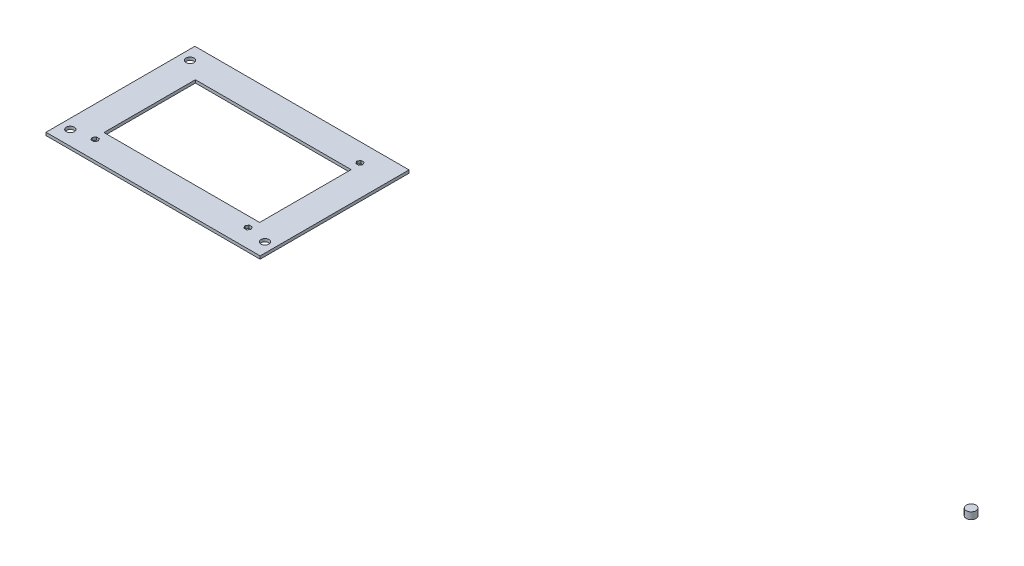
ISO-10303-21;
HEADER;
FILE_DESCRIPTION(('STEP AP214'),'2;1');
FILE_NAME('part.step','',(''),(''),'','','');
FILE_SCHEMA(('AUTOMOTIVE_DESIGN { 1 0 10303 214 1 1 1 1 }'));
ENDSEC;
DATA;
#1=APPLICATION_CONTEXT('core data for automotive mechanical design processes');
#2=APPLICATION_PROTOCOL_DEFINITION('international standard','automotive_design',2000,#1);
#3=PRODUCT_CONTEXT('',#1,'mechanical');
#4=PRODUCT('Part','Part','',(#3));
#5=PRODUCT_RELATED_PRODUCT_CATEGORY('part','',(#4));
#6=PRODUCT_DEFINITION_FORMATION('','',#4);
#7=PRODUCT_DEFINITION_CONTEXT('part definition',#1,'design');
#8=PRODUCT_DEFINITION('design','',#6,#7);
#9=PRODUCT_DEFINITION_SHAPE('','',#8);
#10=(LENGTH_UNIT() NAMED_UNIT(*) SI_UNIT(.MILLI.,.METRE.));
#11=(NAMED_UNIT(*) PLANE_ANGLE_UNIT() SI_UNIT($,.RADIAN.));
#12=(NAMED_UNIT(*) SI_UNIT($,.STERADIAN.) SOLID_ANGLE_UNIT());
#13=UNCERTAINTY_MEASURE_WITH_UNIT(LENGTH_MEASURE(1.E-05),#10,'distance_accuracy_value','');
#14=(GEOMETRIC_REPRESENTATION_CONTEXT(3) GLOBAL_UNCERTAINTY_ASSIGNED_CONTEXT((#13)) GLOBAL_UNIT_ASSIGNED_CONTEXT((#10,
#11,#12)) REPRESENTATION_CONTEXT('',''));
#15=CARTESIAN_POINT('',(0.,0.,0.));
#16=DIRECTION('',(0.,0.,1.));
#17=DIRECTION('',(1.,0.,0.));
#18=AXIS2_PLACEMENT_3D('',#15,#16,#17);
#19=CARTESIAN_POINT('',(706.5,10.,-57.5000000000001));
#20=DIRECTION('',(0.,-1.,0.));
#21=DIRECTION('',(0.,0.,-1.));
#22=AXIS2_PLACEMENT_3D('',#19,#20,#21);
#23=CYLINDRICAL_SURFACE('',#22,5.00000000000005);
#24=CARTESIAN_POINT('',(706.5,10.,-57.5000000000001));
#25=DIRECTION('',(0.,1.,0.));
#26=DIRECTION('',(0.,0.,1.));
#27=AXIS2_PLACEMENT_3D('',#24,#25,#26);
#28=CIRCLE('',#27,5.00000000000005);
#29=CARTESIAN_POINT('',(706.5,10.,-52.5));
#30=VERTEX_POINT('',#29);
#31=EDGE_CURVE('E11',#30,#30,#28,.T.);
#32=ORIENTED_EDGE('',*,*,#31,.F.);
#33=EDGE_LOOP('',(#32));
#34=FACE_BOUND('',#33,.T.);
#35=CARTESIAN_POINT('',(706.5,3.,-57.5000000000001));
#36=DIRECTION('',(0.,1.,0.));
#37=DIRECTION('',(0.,0.,1.));
#38=AXIS2_PLACEMENT_3D('',#35,#36,#37);
#39=CIRCLE('',#38,5.00000000000005);
#40=CARTESIAN_POINT('',(706.5,3.,-52.5));
#41=VERTEX_POINT('',#40);
#42=EDGE_CURVE('E44',#41,#41,#39,.T.);
#43=ORIENTED_EDGE('',*,*,#42,.T.);
#44=EDGE_LOOP('',(#43));
#45=FACE_BOUND('',#44,.T.);
#46=ADVANCED_FACE('F41',(#34,#45),#23,.T.);
#47=CARTESIAN_POINT('',(706.5,10.,-57.5000000000001));
#48=DIRECTION('',(0.,1.,0.));
#49=DIRECTION('',(0.,0.,1.));
#50=AXIS2_PLACEMENT_3D('',#47,#48,#49);
#51=PLANE('',#50);
#52=ORIENTED_EDGE('',*,*,#31,.T.);
#53=EDGE_LOOP('',(#52));
#54=FACE_BOUND('',#53,.T.);
#55=ADVANCED_FACE('F56',(#54),#51,.T.);
#56=CARTESIAN_POINT('',(706.5,3.,-57.5000000000001));
#57=DIRECTION('',(0.,1.,0.));
#58=DIRECTION('',(0.,0.,1.));
#59=AXIS2_PLACEMENT_3D('',#56,#57,#58);
#60=PLANE('',#59);
#61=ORIENTED_EDGE('',*,*,#42,.F.);
#62=EDGE_LOOP('',(#61));
#63=FACE_BOUND('',#62,.T.);
#64=ADVANCED_FACE('F54',(#63),#60,.F.);
#65=CLOSED_SHELL('',(#46,#55,#64));
#66=MANIFOLD_SOLID_BREP('B2',#65);
#67=CARTESIAN_POINT('',(0.,3.,0.));
#68=DIRECTION('',(0.,1.,0.));
#69=DIRECTION('',(0.,0.,1.));
#70=AXIS2_PLACEMENT_3D('',#67,#68,#69);
#71=PLANE('',#70);
#72=DIRECTION('',(0.499999999999996,0.,0.866025403784441));
#73=VECTOR('',#72,1.);
#74=CARTESIAN_POINT('',(-76.9122867597286,3.,54.75));
#75=LINE('',#74,#73);
#76=CARTESIAN_POINT('',(-76.9122867597286,3.,54.75));
#77=VERTEX_POINT('',#76);
#78=CARTESIAN_POINT('',(-75.3245735194571,3.,57.5000000000001));
#79=VERTEX_POINT('',#78);
#80=EDGE_CURVE('E304',#77,#79,#75,.T.);
#81=ORIENTED_EDGE('',*,*,#80,.T.);
#82=DIRECTION('',(-0.5,0.,0.866025403784439));
#83=VECTOR('',#82,1.);
#84=CARTESIAN_POINT('',(-75.3245735194571,3.,57.5000000000001));
#85=LINE('',#84,#83);
#86=CARTESIAN_POINT('',(-76.9122867597286,3.,60.2500000000001));
#87=VERTEX_POINT('',#86);
#88=EDGE_CURVE('E307',#79,#87,#85,.T.);
#89=ORIENTED_EDGE('',*,*,#88,.T.);
#90=DIRECTION('',(-1.,0.,0.));
#91=VECTOR('',#90,1.);
#92=CARTESIAN_POINT('',(-76.9122867597286,3.,60.2500000000001));
#93=LINE('',#92,#91);
#94=CARTESIAN_POINT('',(-80.0877132402715,3.,60.2500000000001));
#95=VERTEX_POINT('',#94);
#96=EDGE_CURVE('E311',#87,#95,#93,.T.);
#97=ORIENTED_EDGE('',*,*,#96,.T.);
#98=DIRECTION('',(-0.5,0.,-0.866025403784439));
#99=VECTOR('',#98,1.);
#100=CARTESIAN_POINT('',(-80.0877132402715,3.,60.2500000000001));
#101=LINE('',#100,#99);
#102=CARTESIAN_POINT('',(-81.6754264805431,3.,57.5));
#103=VERTEX_POINT('',#102);
#104=EDGE_CURVE('E314',#95,#103,#101,.T.);
#105=ORIENTED_EDGE('',*,*,#104,.T.);
#106=DIRECTION('',(0.500000000000005,0.,-0.866025403784435));
#107=VECTOR('',#106,1.);
#108=CARTESIAN_POINT('',(-81.6754264805431,3.,57.5));
#109=LINE('',#108,#107);
#110=CARTESIAN_POINT('',(-80.0877132402715,3.,54.75));
#111=VERTEX_POINT('',#110);
#112=EDGE_CURVE('E317',#103,#111,#109,.T.);
#113=ORIENTED_EDGE('',*,*,#112,.T.);
#114=DIRECTION('',(1.,0.,0.));
#115=VECTOR('',#114,1.);
#116=CARTESIAN_POINT('',(-80.0877132402715,3.,54.75));
#117=LINE('',#116,#115);
#118=EDGE_CURVE('E320',#111,#77,#117,.T.);
#119=ORIENTED_EDGE('',*,*,#118,.T.);
#120=EDGE_LOOP('',(#81,#89,#97,#105,#113,#119));
#121=FACE_BOUND('',#120,.T.);
#122=CARTESIAN_POINT('',(100.,3.,61.5));
#123=DIRECTION('',(0.,1.,0.));
#124=DIRECTION('',(0.,0.,-1.));
#125=AXIS2_PLACEMENT_3D('',#122,#123,#124);
#126=CIRCLE('',#125,4.1);
#127=CARTESIAN_POINT('',(100.,3.,57.4));
#128=VERTEX_POINT('',#127);
#129=EDGE_CURVE('E341',#128,#128,#126,.T.);
#130=ORIENTED_EDGE('',*,*,#129,.F.);
#131=EDGE_LOOP('',(#130));
#132=FACE_BOUND('',#131,.T.);
#133=CARTESIAN_POINT('',(-100.,3.,61.5));
#134=DIRECTION('',(0.,-1.,0.));
#135=DIRECTION('',(0.,0.,-1.));
#136=AXIS2_PLACEMENT_3D('',#133,#134,#135);
#137=CIRCLE('',#136,4.1);
#138=CARTESIAN_POINT('',(-100.,3.,57.4));
#139=VERTEX_POINT('',#138);
#140=EDGE_CURVE('E355',#139,#139,#137,.T.);
#141=ORIENTED_EDGE('',*,*,#140,.T.);
#142=EDGE_LOOP('',(#141));
#143=FACE_BOUND('',#142,.T.);
#144=DIRECTION('',(-0.499999999999996,0.,-0.866025403784441));
#145=VECTOR('',#144,1.);
#146=CARTESIAN_POINT('',(76.9122867597286,3.,-54.75));
#147=LINE('',#146,#145);
#148=CARTESIAN_POINT('',(76.9122867597286,3.,-54.75));
#149=VERTEX_POINT('',#148);
#150=CARTESIAN_POINT('',(75.3245735194571,3.,-57.5000000000001));
#151=VERTEX_POINT('',#150);
#152=EDGE_CURVE('E364',#149,#151,#147,.T.);
#153=ORIENTED_EDGE('',*,*,#152,.T.);
#154=DIRECTION('',(0.5,0.,-0.866025403784439));
#155=VECTOR('',#154,1.);
#156=CARTESIAN_POINT('',(75.3245735194571,3.,-57.5000000000001));
#157=LINE('',#156,#155);
#158=CARTESIAN_POINT('',(76.9122867597286,3.,-60.2500000000001));
#159=VERTEX_POINT('',#158);
#160=EDGE_CURVE('E367',#151,#159,#157,.T.);
#161=ORIENTED_EDGE('',*,*,#160,.T.);
#162=DIRECTION('',(1.,0.,0.));
#163=VECTOR('',#162,1.);
#164=CARTESIAN_POINT('',(76.9122867597286,3.,-60.2500000000001));
#165=LINE('',#164,#163);
#166=CARTESIAN_POINT('',(80.0877132402715,3.,-60.2500000000001));
#167=VERTEX_POINT('',#166);
#168=EDGE_CURVE('E371',#159,#167,#165,.T.);
#169=ORIENTED_EDGE('',*,*,#168,.T.);
#170=DIRECTION('',(0.5,0.,0.866025403784439));
#171=VECTOR('',#170,1.);
#172=CARTESIAN_POINT('',(80.0877132402715,3.,-60.2500000000001));
#173=LINE('',#172,#171);
#174=CARTESIAN_POINT('',(81.6754264805431,3.,-57.5));
#175=VERTEX_POINT('',#174);
#176=EDGE_CURVE('E374',#167,#175,#173,.T.);
#177=ORIENTED_EDGE('',*,*,#176,.T.);
#178=DIRECTION('',(-0.500000000000005,0.,0.866025403784435));
#179=VECTOR('',#178,1.);
#180=CARTESIAN_POINT('',(81.6754264805431,3.,-57.5));
#181=LINE('',#180,#179);
#182=CARTESIAN_POINT('',(80.0877132402715,3.,-54.75));
#183=VERTEX_POINT('',#182);
#184=EDGE_CURVE('E377',#175,#183,#181,.T.);
#185=ORIENTED_EDGE('',*,*,#184,.T.);
#186=DIRECTION('',(-1.,0.,0.));
#187=VECTOR('',#186,1.);
#188=CARTESIAN_POINT('',(80.0877132402715,3.,-54.75));
#189=LINE('',#188,#187);
#190=EDGE_CURVE('E380',#183,#149,#189,.T.);
#191=ORIENTED_EDGE('',*,*,#190,.T.);
#192=EDGE_LOOP('',(#153,#161,#169,#177,#185,#191));
#193=FACE_BOUND('',#192,.T.);
#194=CARTESIAN_POINT('',(-100.,3.,-61.5));
#195=DIRECTION('',(0.,1.,0.));
#196=DIRECTION('',(0.,0.,1.));
#197=AXIS2_PLACEMENT_3D('',#194,#195,#196);
#198=CIRCLE('',#197,4.1);
#199=CARTESIAN_POINT('',(-100.,3.,-57.4));
#200=VERTEX_POINT('',#199);
#201=EDGE_CURVE('E401',#200,#200,#198,.T.);
#202=ORIENTED_EDGE('',*,*,#201,.F.);
#203=EDGE_LOOP('',(#202));
#204=FACE_BOUND('',#203,.T.);
#205=DIRECTION('',(0.,0.,-1.));
#206=VECTOR('',#205,1.);
#207=CARTESIAN_POINT('',(80.,3.,-47.));
#208=LINE('',#207,#206);
#209=CARTESIAN_POINT('',(80.,3.,47.));
#210=VERTEX_POINT('',#209);
#211=CARTESIAN_POINT('',(80.,3.,-47.));
#212=VERTEX_POINT('',#211);
#213=EDGE_CURVE('E415',#210,#212,#208,.T.);
#214=ORIENTED_EDGE('',*,*,#213,.F.);
#215=DIRECTION('',(1.,0.,0.));
#216=VECTOR('',#215,1.);
#217=CARTESIAN_POINT('',(-80.,3.,47.));
#218=LINE('',#217,#216);
#219=CARTESIAN_POINT('',(-80.,3.,47.));
#220=VERTEX_POINT('',#219);
#221=EDGE_CURVE('E422',#220,#210,#218,.T.);
#222=ORIENTED_EDGE('',*,*,#221,.F.);
#223=DIRECTION('',(0.,0.,1.));
#224=VECTOR('',#223,1.);
#225=CARTESIAN_POINT('',(-80.,3.,-47.));
#226=LINE('',#225,#224);
#227=CARTESIAN_POINT('',(-80.,3.,-47.));
#228=VERTEX_POINT('',#227);
#229=EDGE_CURVE('E436',#228,#220,#226,.T.);
#230=ORIENTED_EDGE('',*,*,#229,.F.);
#231=DIRECTION('',(-1.,0.,0.));
#232=VECTOR('',#231,1.);
#233=CARTESIAN_POINT('',(-80.,3.,-47.));
#234=LINE('',#233,#232);
#235=EDGE_CURVE('E433',#212,#228,#234,.T.);
#236=ORIENTED_EDGE('',*,*,#235,.F.);
#237=EDGE_LOOP('',(#214,#222,#230,#236));
#238=FACE_BOUND('',#237,.T.);
#239=DIRECTION('',(0.,0.,-1.));
#240=VECTOR('',#239,1.);
#241=CARTESIAN_POINT('',(110.,3.,-76.5));
#242=LINE('',#241,#240);
#243=CARTESIAN_POINT('',(110.,3.,76.5));
#244=VERTEX_POINT('',#243);
#245=CARTESIAN_POINT('',(110.,3.,-76.5));
#246=VERTEX_POINT('',#245);
#247=EDGE_CURVE('E450',#244,#246,#242,.T.);
#248=ORIENTED_EDGE('',*,*,#247,.T.);
#249=DIRECTION('',(-1.,0.,0.));
#250=VECTOR('',#249,1.);
#251=CARTESIAN_POINT('',(-110.,3.,-76.5));
#252=LINE('',#251,#250);
#253=CARTESIAN_POINT('',(-110.,3.,-76.5));
#254=VERTEX_POINT('',#253);
#255=EDGE_CURVE('E453',#246,#254,#252,.T.);
#256=ORIENTED_EDGE('',*,*,#255,.T.);
#257=DIRECTION('',(0.,0.,1.));
#258=VECTOR('',#257,1.);
#259=CARTESIAN_POINT('',(-110.,3.,-76.5));
#260=LINE('',#259,#258);
#261=CARTESIAN_POINT('',(-110.,3.,76.5));
#262=VERTEX_POINT('',#261);
#263=EDGE_CURVE('E456',#254,#262,#260,.T.);
#264=ORIENTED_EDGE('',*,*,#263,.T.);
#265=DIRECTION('',(1.,0.,0.));
#266=VECTOR('',#265,1.);
#267=CARTESIAN_POINT('',(-110.,3.,76.5));
#268=LINE('',#267,#266);
#269=EDGE_CURVE('E458',#262,#244,#268,.T.);
#270=ORIENTED_EDGE('',*,*,#269,.T.);
#271=EDGE_LOOP('',(#248,#256,#264,#270));
#272=FACE_BOUND('',#271,.T.);
#273=DIRECTION('',(0.5,0.,0.866025403784439));
#274=VECTOR('',#273,1.);
#275=CARTESIAN_POINT('',(75.3245735194571,3.,57.5000000000001));
#276=LINE('',#275,#274);
#277=CARTESIAN_POINT('',(75.3245735194571,3.,57.5000000000001));
#278=VERTEX_POINT('',#277);
#279=CARTESIAN_POINT('',(76.9122867597286,3.,60.2500000000001));
#280=VERTEX_POINT('',#279);
#281=EDGE_CURVE('E267',#278,#280,#276,.T.);
#282=ORIENTED_EDGE('',*,*,#281,.F.);
#283=DIRECTION('',(-0.499999999999996,0.,0.866025403784441));
#284=VECTOR('',#283,1.);
#285=CARTESIAN_POINT('',(76.9122867597286,3.,54.75));
#286=LINE('',#285,#284);
#287=CARTESIAN_POINT('',(76.9122867597286,3.,54.75));
#288=VERTEX_POINT('',#287);
#289=EDGE_CURVE('E263',#288,#278,#286,.T.);
#290=ORIENTED_EDGE('',*,*,#289,.F.);
#291=DIRECTION('',(-1.,0.,0.));
#292=VECTOR('',#291,1.);
#293=CARTESIAN_POINT('',(80.0877132402715,3.,54.75));
#294=LINE('',#293,#292);
#295=CARTESIAN_POINT('',(80.0877132402715,3.,54.75));
#296=VERTEX_POINT('',#295);
#297=EDGE_CURVE('E255',#296,#288,#294,.T.);
#298=ORIENTED_EDGE('',*,*,#297,.F.);
#299=DIRECTION('',(-0.500000000000005,0.,-0.866025403784435));
#300=VECTOR('',#299,1.);
#301=CARTESIAN_POINT('',(81.6754264805431,3.,57.5));
#302=LINE('',#301,#300);
#303=CARTESIAN_POINT('',(81.6754264805431,3.,57.5));
#304=VERTEX_POINT('',#303);
#305=EDGE_CURVE('E262',#304,#296,#302,.T.);
#306=ORIENTED_EDGE('',*,*,#305,.F.);
#307=DIRECTION('',(0.5,0.,-0.866025403784439));
#308=VECTOR('',#307,1.);
#309=CARTESIAN_POINT('',(80.0877132402715,3.,60.2500000000001));
#310=LINE('',#309,#308);
#311=CARTESIAN_POINT('',(80.0877132402715,3.,60.2500000000001));
#312=VERTEX_POINT('',#311);
#313=EDGE_CURVE('E278',#312,#304,#310,.T.);
#314=ORIENTED_EDGE('',*,*,#313,.F.);
#315=DIRECTION('',(1.,0.,0.));
#316=VECTOR('',#315,1.);
#317=CARTESIAN_POINT('',(76.9122867597286,3.,60.2500000000001));
#318=LINE('',#317,#316);
#319=EDGE_CURVE('E280',#280,#312,#318,.T.);
#320=ORIENTED_EDGE('',*,*,#319,.F.);
#321=EDGE_LOOP('',(#282,#290,#298,#306,#314,#320));
#322=FACE_BOUND('',#321,.T.);
#323=ADVANCED_FACE('F82',(#121,#132,#143,#193,#204,#238,#272,#322),#71,.T.);
#324=CARTESIAN_POINT('',(0.,0.,0.));
#325=DIRECTION('',(0.,1.,0.));
#326=DIRECTION('',(0.,0.,1.));
#327=AXIS2_PLACEMENT_3D('',#324,#325,#326);
#328=PLANE('',#327);
#329=DIRECTION('',(0.,0.,-1.));
#330=VECTOR('',#329,1.);
#331=CARTESIAN_POINT('',(110.,0.,-76.5));
#332=LINE('',#331,#330);
#333=CARTESIAN_POINT('',(110.,0.,76.5));
#334=VERTEX_POINT('',#333);
#335=CARTESIAN_POINT('',(110.,0.,-76.5));
#336=VERTEX_POINT('',#335);
#337=EDGE_CURVE('E443',#334,#336,#332,.T.);
#338=ORIENTED_EDGE('',*,*,#337,.F.);
#339=DIRECTION('',(1.,0.,0.));
#340=VECTOR('',#339,1.);
#341=CARTESIAN_POINT('',(-110.,0.,76.5));
#342=LINE('',#341,#340);
#343=CARTESIAN_POINT('',(-110.,0.,76.5));
#344=VERTEX_POINT('',#343);
#345=EDGE_CURVE('E454',#344,#334,#342,.T.);
#346=ORIENTED_EDGE('',*,*,#345,.F.);
#347=DIRECTION('',(0.,0.,1.));
#348=VECTOR('',#347,1.);
#349=CARTESIAN_POINT('',(-110.,0.,-76.5));
#350=LINE('',#349,#348);
#351=CARTESIAN_POINT('',(-110.,0.,-76.5));
#352=VERTEX_POINT('',#351);
#353=EDGE_CURVE('E465',#352,#344,#350,.T.);
#354=ORIENTED_EDGE('',*,*,#353,.F.);
#355=DIRECTION('',(-1.,0.,0.));
#356=VECTOR('',#355,1.);
#357=CARTESIAN_POINT('',(-110.,0.,-76.5));
#358=LINE('',#357,#356);
#359=EDGE_CURVE('E463',#336,#352,#358,.T.);
#360=ORIENTED_EDGE('',*,*,#359,.F.);
#361=EDGE_LOOP('',(#338,#346,#354,#360));
#362=FACE_BOUND('',#361,.T.);
#363=DIRECTION('',(1.,0.,0.));
#364=VECTOR('',#363,1.);
#365=CARTESIAN_POINT('',(-80.,0.,47.));
#366=LINE('',#365,#364);
#367=CARTESIAN_POINT('',(-80.,0.,47.));
#368=VERTEX_POINT('',#367);
#369=CARTESIAN_POINT('',(80.,0.,47.));
#370=VERTEX_POINT('',#369);
#371=EDGE_CURVE('E428',#368,#370,#366,.T.);
#372=ORIENTED_EDGE('',*,*,#371,.T.);
#373=DIRECTION('',(0.,0.,-1.));
#374=VECTOR('',#373,1.);
#375=CARTESIAN_POINT('',(80.,0.,-47.));
#376=LINE('',#375,#374);
#377=CARTESIAN_POINT('',(80.,0.,-47.));
#378=VERTEX_POINT('',#377);
#379=EDGE_CURVE('E418',#370,#378,#376,.T.);
#380=ORIENTED_EDGE('',*,*,#379,.T.);
#381=DIRECTION('',(-1.,0.,0.));
#382=VECTOR('',#381,1.);
#383=CARTESIAN_POINT('',(-80.,0.,-47.));
#384=LINE('',#383,#382);
#385=CARTESIAN_POINT('',(-80.,0.,-47.));
#386=VERTEX_POINT('',#385);
#387=EDGE_CURVE('E421',#378,#386,#384,.T.);
#388=ORIENTED_EDGE('',*,*,#387,.T.);
#389=DIRECTION('',(0.,0.,1.));
#390=VECTOR('',#389,1.);
#391=CARTESIAN_POINT('',(-80.,0.,-47.));
#392=LINE('',#391,#390);
#393=EDGE_CURVE('E425',#386,#368,#392,.T.);
#394=ORIENTED_EDGE('',*,*,#393,.T.);
#395=EDGE_LOOP('',(#372,#380,#388,#394));
#396=FACE_BOUND('',#395,.T.);
#397=CARTESIAN_POINT('',(-100.,0.,-61.5));
#398=DIRECTION('',(0.,1.,0.));
#399=DIRECTION('',(0.,0.,1.));
#400=AXIS2_PLACEMENT_3D('',#397,#398,#399);
#401=CIRCLE('',#400,4.1);
#402=CARTESIAN_POINT('',(-100.,0.,-57.4));
#403=VERTEX_POINT('',#402);
#404=EDGE_CURVE('E412',#403,#403,#401,.T.);
#405=ORIENTED_EDGE('',*,*,#404,.T.);
#406=EDGE_LOOP('',(#405));
#407=FACE_BOUND('',#406,.T.);
#408=DIRECTION('',(0.5,0.,-0.866025403784439));
#409=VECTOR('',#408,1.);
#410=CARTESIAN_POINT('',(75.3245735194571,0.,-57.5000000000001));
#411=LINE('',#410,#409);
#412=CARTESIAN_POINT('',(75.3245735194571,0.,-57.5000000000001));
#413=VERTEX_POINT('',#412);
#414=CARTESIAN_POINT('',(76.9122867597286,0.,-60.2500000000001));
#415=VERTEX_POINT('',#414);
#416=EDGE_CURVE('E385',#413,#415,#411,.T.);
#417=ORIENTED_EDGE('',*,*,#416,.F.);
#418=DIRECTION('',(-0.499999999999996,0.,-0.866025403784441));
#419=VECTOR('',#418,1.);
#420=CARTESIAN_POINT('',(76.9122867597286,0.,-54.75));
#421=LINE('',#420,#419);
#422=CARTESIAN_POINT('',(76.9122867597286,0.,-54.75));
#423=VERTEX_POINT('',#422);
#424=EDGE_CURVE('E361',#423,#413,#421,.T.);
#425=ORIENTED_EDGE('',*,*,#424,.F.);
#426=DIRECTION('',(-1.,0.,0.));
#427=VECTOR('',#426,1.);
#428=CARTESIAN_POINT('',(80.0877132402715,0.,-54.75));
#429=LINE('',#428,#427);
#430=CARTESIAN_POINT('',(80.0877132402715,0.,-54.75));
#431=VERTEX_POINT('',#430);
#432=EDGE_CURVE('E368',#431,#423,#429,.T.);
#433=ORIENTED_EDGE('',*,*,#432,.F.);
#434=DIRECTION('',(-0.500000000000005,0.,0.866025403784435));
#435=VECTOR('',#434,1.);
#436=CARTESIAN_POINT('',(81.6754264805431,0.,-57.5));
#437=LINE('',#436,#435);
#438=CARTESIAN_POINT('',(81.6754264805431,0.,-57.5));
#439=VERTEX_POINT('',#438);
#440=EDGE_CURVE('E394',#439,#431,#437,.T.);
#441=ORIENTED_EDGE('',*,*,#440,.F.);
#442=DIRECTION('',(0.5,0.,0.866025403784439));
#443=VECTOR('',#442,1.);
#444=CARTESIAN_POINT('',(80.0877132402715,0.,-60.2500000000001));
#445=LINE('',#444,#443);
#446=CARTESIAN_POINT('',(80.0877132402715,0.,-60.2500000000001));
#447=VERTEX_POINT('',#446);
#448=EDGE_CURVE('E391',#447,#439,#445,.T.);
#449=ORIENTED_EDGE('',*,*,#448,.F.);
#450=DIRECTION('',(1.,0.,0.));
#451=VECTOR('',#450,1.);
#452=CARTESIAN_POINT('',(76.9122867597286,0.,-60.2500000000001));
#453=LINE('',#452,#451);
#454=EDGE_CURVE('E388',#415,#447,#453,.T.);
#455=ORIENTED_EDGE('',*,*,#454,.F.);
#456=EDGE_LOOP('',(#417,#425,#433,#441,#449,#455));
#457=FACE_BOUND('',#456,.T.);
#458=CARTESIAN_POINT('',(-100.,0.,61.5));
#459=DIRECTION('',(0.,-1.,0.));
#460=DIRECTION('',(0.,0.,-1.));
#461=AXIS2_PLACEMENT_3D('',#458,#459,#460);
#462=CIRCLE('',#461,4.1);
#463=CARTESIAN_POINT('',(-100.,0.,57.4));
#464=VERTEX_POINT('',#463);
#465=EDGE_CURVE('E358',#464,#464,#462,.T.);
#466=ORIENTED_EDGE('',*,*,#465,.F.);
#467=EDGE_LOOP('',(#466));
#468=FACE_BOUND('',#467,.T.);
#469=CARTESIAN_POINT('',(100.,0.,61.5));
#470=DIRECTION('',(0.,1.,0.));
#471=DIRECTION('',(0.,0.,-1.));
#472=AXIS2_PLACEMENT_3D('',#469,#470,#471);
#473=CIRCLE('',#472,4.1);
#474=CARTESIAN_POINT('',(100.,0.,57.4));
#475=VERTEX_POINT('',#474);
#476=EDGE_CURVE('E352',#475,#475,#473,.T.);
#477=ORIENTED_EDGE('',*,*,#476,.T.);
#478=EDGE_LOOP('',(#477));
#479=FACE_BOUND('',#478,.T.);
#480=DIRECTION('',(-0.5,0.,0.866025403784439));
#481=VECTOR('',#480,1.);
#482=CARTESIAN_POINT('',(-75.3245735194571,0.,57.5000000000001));
#483=LINE('',#482,#481);
#484=CARTESIAN_POINT('',(-75.3245735194571,0.,57.5000000000001));
#485=VERTEX_POINT('',#484);
#486=CARTESIAN_POINT('',(-76.9122867597286,0.,60.2500000000001));
#487=VERTEX_POINT('',#486);
#488=EDGE_CURVE('E325',#485,#487,#483,.T.);
#489=ORIENTED_EDGE('',*,*,#488,.F.);
#490=DIRECTION('',(0.499999999999996,0.,0.866025403784441));
#491=VECTOR('',#490,1.);
#492=CARTESIAN_POINT('',(-76.9122867597286,0.,54.75));
#493=LINE('',#492,#491);
#494=CARTESIAN_POINT('',(-76.9122867597286,0.,54.75));
#495=VERTEX_POINT('',#494);
#496=EDGE_CURVE('E296',#495,#485,#493,.T.);
#497=ORIENTED_EDGE('',*,*,#496,.F.);
#498=DIRECTION('',(1.,0.,0.));
#499=VECTOR('',#498,1.);
#500=CARTESIAN_POINT('',(-80.0877132402715,0.,54.75));
#501=LINE('',#500,#499);
#502=CARTESIAN_POINT('',(-80.0877132402715,0.,54.75));
#503=VERTEX_POINT('',#502);
#504=EDGE_CURVE('E308',#503,#495,#501,.T.);
#505=ORIENTED_EDGE('',*,*,#504,.F.);
#506=DIRECTION('',(0.500000000000005,0.,-0.866025403784435));
#507=VECTOR('',#506,1.);
#508=CARTESIAN_POINT('',(-81.6754264805431,0.,57.5));
#509=LINE('',#508,#507);
#510=CARTESIAN_POINT('',(-81.6754264805431,0.,57.5));
#511=VERTEX_POINT('',#510);
#512=EDGE_CURVE('E334',#511,#503,#509,.T.);
#513=ORIENTED_EDGE('',*,*,#512,.F.);
#514=DIRECTION('',(-0.5,0.,-0.866025403784439));
#515=VECTOR('',#514,1.);
#516=CARTESIAN_POINT('',(-80.0877132402715,0.,60.2500000000001));
#517=LINE('',#516,#515);
#518=CARTESIAN_POINT('',(-80.0877132402715,0.,60.2500000000001));
#519=VERTEX_POINT('',#518);
#520=EDGE_CURVE('E331',#519,#511,#517,.T.);
#521=ORIENTED_EDGE('',*,*,#520,.F.);
#522=DIRECTION('',(-1.,0.,0.));
#523=VECTOR('',#522,1.);
#524=CARTESIAN_POINT('',(-76.9122867597286,0.,60.2500000000001));
#525=LINE('',#524,#523);
#526=EDGE_CURVE('E328',#487,#519,#525,.T.);
#527=ORIENTED_EDGE('',*,*,#526,.F.);
#528=EDGE_LOOP('',(#489,#497,#505,#513,#521,#527));
#529=FACE_BOUND('',#528,.T.);
#530=DIRECTION('',(-0.499999999999996,0.,0.866025403784441));
#531=VECTOR('',#530,1.);
#532=CARTESIAN_POINT('',(76.9122867597286,0.,54.75));
#533=LINE('',#532,#531);
#534=CARTESIAN_POINT('',(76.9122867597286,0.,54.75));
#535=VERTEX_POINT('',#534);
#536=CARTESIAN_POINT('',(75.3245735194571,0.,57.5000000000001));
#537=VERTEX_POINT('',#536);
#538=EDGE_CURVE('E105',#535,#537,#533,.T.);
#539=ORIENTED_EDGE('',*,*,#538,.T.);
#540=DIRECTION('',(0.5,0.,0.866025403784439));
#541=VECTOR('',#540,1.);
#542=CARTESIAN_POINT('',(75.3245735194571,0.,57.5000000000001));
#543=LINE('',#542,#541);
#544=CARTESIAN_POINT('',(76.9122867597286,0.,60.2500000000001));
#545=VERTEX_POINT('',#544);
#546=EDGE_CURVE('E271',#537,#545,#543,.T.);
#547=ORIENTED_EDGE('',*,*,#546,.T.);
#548=DIRECTION('',(1.,0.,0.));
#549=VECTOR('',#548,1.);
#550=CARTESIAN_POINT('',(76.9122867597286,0.,60.2500000000001));
#551=LINE('',#550,#549);
#552=CARTESIAN_POINT('',(80.0877132402715,0.,60.2500000000001));
#553=VERTEX_POINT('',#552);
#554=EDGE_CURVE('E274',#545,#553,#551,.T.);
#555=ORIENTED_EDGE('',*,*,#554,.T.);
#556=DIRECTION('',(0.5,0.,-0.866025403784439));
#557=VECTOR('',#556,1.);
#558=CARTESIAN_POINT('',(80.0877132402715,0.,60.2500000000001));
#559=LINE('',#558,#557);
#560=CARTESIAN_POINT('',(81.6754264805431,0.,57.5));
#561=VERTEX_POINT('',#560);
#562=EDGE_CURVE('E289',#553,#561,#559,.T.);
#563=ORIENTED_EDGE('',*,*,#562,.T.);
#564=DIRECTION('',(-0.500000000000005,0.,-0.866025403784435));
#565=VECTOR('',#564,1.);
#566=CARTESIAN_POINT('',(81.6754264805431,0.,57.5));
#567=LINE('',#566,#565);
#568=CARTESIAN_POINT('',(80.0877132402715,0.,54.75));
#569=VERTEX_POINT('',#568);
#570=EDGE_CURVE('E286',#561,#569,#567,.T.);
#571=ORIENTED_EDGE('',*,*,#570,.T.);
#572=DIRECTION('',(-1.,0.,0.));
#573=VECTOR('',#572,1.);
#574=CARTESIAN_POINT('',(80.0877132402715,0.,54.75));
#575=LINE('',#574,#573);
#576=EDGE_CURVE('E284',#569,#535,#575,.T.);
#577=ORIENTED_EDGE('',*,*,#576,.T.);
#578=EDGE_LOOP('',(#539,#547,#555,#563,#571,#577));
#579=FACE_BOUND('',#578,.T.);
#580=ADVANCED_FACE('F483',(#362,#396,#407,#457,#468,#479,#529,#579),#328,.F.);
#581=CARTESIAN_POINT('',(110.,3.,-76.5));
#582=DIRECTION('',(-1.,0.,0.));
#583=DIRECTION('',(0.,0.,1.));
#584=AXIS2_PLACEMENT_3D('',#581,#582,#583);
#585=PLANE('',#584);
#586=ORIENTED_EDGE('',*,*,#337,.T.);
#587=DIRECTION('',(0.,-1.,0.));
#588=VECTOR('',#587,1.);
#589=CARTESIAN_POINT('',(110.,3.,-76.5));
#590=LINE('',#589,#588);
#591=EDGE_CURVE('E39',#246,#336,#590,.T.);
#592=ORIENTED_EDGE('',*,*,#591,.F.);
#593=ORIENTED_EDGE('',*,*,#247,.F.);
#594=DIRECTION('',(0.,-1.,0.));
#595=VECTOR('',#594,1.);
#596=CARTESIAN_POINT('',(110.,3.,76.5));
#597=LINE('',#596,#595);
#598=EDGE_CURVE('E460',#244,#334,#597,.T.);
#599=ORIENTED_EDGE('',*,*,#598,.T.);
#600=EDGE_LOOP('',(#586,#592,#593,#599));
#601=FACE_BOUND('',#600,.T.);
#602=ADVANCED_FACE('F84',(#601),#585,.F.);
#603=CARTESIAN_POINT('',(-110.,3.,-76.5));
#604=DIRECTION('',(0.,0.,1.));
#605=DIRECTION('',(1.,0.,0.));
#606=AXIS2_PLACEMENT_3D('',#603,#604,#605);
#607=PLANE('',#606);
#608=ORIENTED_EDGE('',*,*,#359,.T.);
#609=DIRECTION('',(0.,-1.,0.));
#610=VECTOR('',#609,1.);
#611=CARTESIAN_POINT('',(-110.,3.,-76.5));
#612=LINE('',#611,#610);
#613=EDGE_CURVE('E90',#254,#352,#612,.T.);
#614=ORIENTED_EDGE('',*,*,#613,.F.);
#615=ORIENTED_EDGE('',*,*,#255,.F.);
#616=ORIENTED_EDGE('',*,*,#591,.T.);
#617=EDGE_LOOP('',(#608,#614,#615,#616));
#618=FACE_BOUND('',#617,.T.);
#619=ADVANCED_FACE('F493',(#618),#607,.F.);
#620=CARTESIAN_POINT('',(-110.,3.,-76.5));
#621=DIRECTION('',(1.,0.,0.));
#622=DIRECTION('',(0.,0.,-1.));
#623=AXIS2_PLACEMENT_3D('',#620,#621,#622);
#624=PLANE('',#623);
#625=ORIENTED_EDGE('',*,*,#353,.T.);
#626=DIRECTION('',(0.,-1.,0.));
#627=VECTOR('',#626,1.);
#628=CARTESIAN_POINT('',(-110.,3.,76.5));
#629=LINE('',#628,#627);
#630=EDGE_CURVE('E470',#262,#344,#629,.T.);
#631=ORIENTED_EDGE('',*,*,#630,.F.);
#632=ORIENTED_EDGE('',*,*,#263,.F.);
#633=ORIENTED_EDGE('',*,*,#613,.T.);
#634=EDGE_LOOP('',(#625,#631,#632,#633));
#635=FACE_BOUND('',#634,.T.);
#636=ADVANCED_FACE('F477',(#635),#624,.F.);
#637=CARTESIAN_POINT('',(-110.,3.,76.5));
#638=DIRECTION('',(0.,0.,-1.));
#639=DIRECTION('',(-1.,0.,0.));
#640=AXIS2_PLACEMENT_3D('',#637,#638,#639);
#641=PLANE('',#640);
#642=ORIENTED_EDGE('',*,*,#345,.T.);
#643=ORIENTED_EDGE('',*,*,#598,.F.);
#644=ORIENTED_EDGE('',*,*,#269,.F.);
#645=ORIENTED_EDGE('',*,*,#630,.T.);
#646=EDGE_LOOP('',(#642,#643,#644,#645));
#647=FACE_BOUND('',#646,.T.);
#648=ADVANCED_FACE('F487',(#647),#641,.F.);
#649=CARTESIAN_POINT('',(80.,0.,-47.));
#650=DIRECTION('',(1.,0.,0.));
#651=DIRECTION('',(0.,0.,-1.));
#652=AXIS2_PLACEMENT_3D('',#649,#650,#651);
#653=PLANE('',#652);
#654=ORIENTED_EDGE('',*,*,#213,.T.);
#655=DIRECTION('',(0.,1.,0.));
#656=VECTOR('',#655,1.);
#657=CARTESIAN_POINT('',(80.,0.,-47.));
#658=LINE('',#657,#656);
#659=EDGE_CURVE('E431',#378,#212,#658,.T.);
#660=ORIENTED_EDGE('',*,*,#659,.F.);
#661=ORIENTED_EDGE('',*,*,#379,.F.);
#662=DIRECTION('',(0.,1.,0.));
#663=VECTOR('',#662,1.);
#664=CARTESIAN_POINT('',(80.,0.,47.));
#665=LINE('',#664,#663);
#666=EDGE_CURVE('E441',#370,#210,#665,.T.);
#667=ORIENTED_EDGE('',*,*,#666,.T.);
#668=EDGE_LOOP('',(#654,#660,#661,#667));
#669=FACE_BOUND('',#668,.T.);
#670=ADVANCED_FACE('F509',(#669),#653,.F.);
#671=CARTESIAN_POINT('',(-80.,0.,47.));
#672=DIRECTION('',(0.,0.,1.));
#673=DIRECTION('',(1.,0.,0.));
#674=AXIS2_PLACEMENT_3D('',#671,#672,#673);
#675=PLANE('',#674);
#676=ORIENTED_EDGE('',*,*,#221,.T.);
#677=ORIENTED_EDGE('',*,*,#666,.F.);
#678=ORIENTED_EDGE('',*,*,#371,.F.);
#679=DIRECTION('',(0.,1.,0.));
#680=VECTOR('',#679,1.);
#681=CARTESIAN_POINT('',(-80.,0.,47.));
#682=LINE('',#681,#680);
#683=EDGE_CURVE('E444',#368,#220,#682,.T.);
#684=ORIENTED_EDGE('',*,*,#683,.T.);
#685=EDGE_LOOP('',(#676,#677,#678,#684));
#686=FACE_BOUND('',#685,.T.);
#687=ADVANCED_FACE('F516',(#686),#675,.F.);
#688=CARTESIAN_POINT('',(-80.,0.,-47.));
#689=DIRECTION('',(-1.,0.,0.));
#690=DIRECTION('',(0.,0.,1.));
#691=AXIS2_PLACEMENT_3D('',#688,#689,#690);
#692=PLANE('',#691);
#693=ORIENTED_EDGE('',*,*,#229,.T.);
#694=ORIENTED_EDGE('',*,*,#683,.F.);
#695=ORIENTED_EDGE('',*,*,#393,.F.);
#696=DIRECTION('',(0.,1.,0.));
#697=VECTOR('',#696,1.);
#698=CARTESIAN_POINT('',(-80.,0.,-47.));
#699=LINE('',#698,#697);
#700=EDGE_CURVE('E446',#386,#228,#699,.T.);
#701=ORIENTED_EDGE('',*,*,#700,.T.);
#702=EDGE_LOOP('',(#693,#694,#695,#701));
#703=FACE_BOUND('',#702,.T.);
#704=ADVANCED_FACE('F521',(#703),#692,.F.);
#705=CARTESIAN_POINT('',(-80.,0.,-47.));
#706=DIRECTION('',(0.,0.,-1.));
#707=DIRECTION('',(-1.,0.,0.));
#708=AXIS2_PLACEMENT_3D('',#705,#706,#707);
#709=PLANE('',#708);
#710=ORIENTED_EDGE('',*,*,#235,.T.);
#711=ORIENTED_EDGE('',*,*,#700,.F.);
#712=ORIENTED_EDGE('',*,*,#387,.F.);
#713=ORIENTED_EDGE('',*,*,#659,.T.);
#714=EDGE_LOOP('',(#710,#711,#712,#713));
#715=FACE_BOUND('',#714,.T.);
#716=ADVANCED_FACE('F531',(#715),#709,.F.);
#717=CARTESIAN_POINT('',(-100.,0.,-61.5));
#718=DIRECTION('',(0.,1.,0.));
#719=DIRECTION('',(0.,0.,1.));
#720=AXIS2_PLACEMENT_3D('',#717,#718,#719);
#721=CYLINDRICAL_SURFACE('',#720,4.1);
#722=ORIENTED_EDGE('',*,*,#404,.F.);
#723=EDGE_LOOP('',(#722));
#724=FACE_BOUND('',#723,.T.);
#725=ORIENTED_EDGE('',*,*,#201,.T.);
#726=EDGE_LOOP('',(#725));
#727=FACE_BOUND('',#726,.T.);
#728=ADVANCED_FACE('F636',(#724,#727),#721,.F.);
#729=CARTESIAN_POINT('',(76.9122867597286,3.,-54.75));
#730=DIRECTION('',(-0.866025403784441,0.,0.499999999999996));
#731=DIRECTION('',(0.499999999999996,0.,0.866025403784441));
#732=AXIS2_PLACEMENT_3D('',#729,#730,#731);
#733=PLANE('',#732);
#734=ORIENTED_EDGE('',*,*,#424,.T.);
#735=DIRECTION('',(0.,-1.,0.));
#736=VECTOR('',#735,1.);
#737=CARTESIAN_POINT('',(75.3245735194571,3.,-57.5000000000001));
#738=LINE('',#737,#736);
#739=EDGE_CURVE('E383',#151,#413,#738,.T.);
#740=ORIENTED_EDGE('',*,*,#739,.F.);
#741=ORIENTED_EDGE('',*,*,#152,.F.);
#742=DIRECTION('',(0.,-1.,0.));
#743=VECTOR('',#742,1.);
#744=CARTESIAN_POINT('',(76.9122867597286,3.,-54.75));
#745=LINE('',#744,#743);
#746=EDGE_CURVE('E399',#149,#423,#745,.T.);
#747=ORIENTED_EDGE('',*,*,#746,.T.);
#748=EDGE_LOOP('',(#734,#740,#741,#747));
#749=FACE_BOUND('',#748,.T.);
#750=ADVANCED_FACE('F618',(#749),#733,.F.);
#751=CARTESIAN_POINT('',(80.0877132402715,3.,-54.75));
#752=DIRECTION('',(0.,0.,1.));
#753=DIRECTION('',(1.,0.,0.));
#754=AXIS2_PLACEMENT_3D('',#751,#752,#753);
#755=PLANE('',#754);
#756=ORIENTED_EDGE('',*,*,#432,.T.);
#757=ORIENTED_EDGE('',*,*,#746,.F.);
#758=ORIENTED_EDGE('',*,*,#190,.F.);
#759=DIRECTION('',(0.,-1.,0.));
#760=VECTOR('',#759,1.);
#761=CARTESIAN_POINT('',(80.0877132402715,3.,-54.75));
#762=LINE('',#761,#760);
#763=EDGE_CURVE('E402',#183,#431,#762,.T.);
#764=ORIENTED_EDGE('',*,*,#763,.T.);
#765=EDGE_LOOP('',(#756,#757,#758,#764));
#766=FACE_BOUND('',#765,.T.);
#767=ADVANCED_FACE('F614',(#766),#755,.F.);
#768=CARTESIAN_POINT('',(81.6754264805431,3.,-57.5));
#769=DIRECTION('',(0.866025403784435,0.,0.500000000000005));
#770=DIRECTION('',(0.500000000000005,0.,-0.866025403784435));
#771=AXIS2_PLACEMENT_3D('',#768,#769,#770);
#772=PLANE('',#771);
#773=ORIENTED_EDGE('',*,*,#440,.T.);
#774=ORIENTED_EDGE('',*,*,#763,.F.);
#775=ORIENTED_EDGE('',*,*,#184,.F.);
#776=DIRECTION('',(0.,-1.,0.));
#777=VECTOR('',#776,1.);
#778=CARTESIAN_POINT('',(81.6754264805431,3.,-57.5));
#779=LINE('',#778,#777);
#780=EDGE_CURVE('E404',#175,#439,#779,.T.);
#781=ORIENTED_EDGE('',*,*,#780,.T.);
#782=EDGE_LOOP('',(#773,#774,#775,#781));
#783=FACE_BOUND('',#782,.T.);
#784=ADVANCED_FACE('F617',(#783),#772,.F.);
#785=CARTESIAN_POINT('',(80.0877132402715,3.,-60.2500000000001));
#786=DIRECTION('',(0.866025403784439,0.,-0.5));
#787=DIRECTION('',(-0.5,0.,-0.866025403784439));
#788=AXIS2_PLACEMENT_3D('',#785,#786,#787);
#789=PLANE('',#788);
#790=ORIENTED_EDGE('',*,*,#448,.T.);
#791=ORIENTED_EDGE('',*,*,#780,.F.);
#792=ORIENTED_EDGE('',*,*,#176,.F.);
#793=DIRECTION('',(0.,-1.,0.));
#794=VECTOR('',#793,1.);
#795=CARTESIAN_POINT('',(80.0877132402715,3.,-60.2500000000001));
#796=LINE('',#795,#794);
#797=EDGE_CURVE('E406',#167,#447,#796,.T.);
#798=ORIENTED_EDGE('',*,*,#797,.T.);
#799=EDGE_LOOP('',(#790,#791,#792,#798));
#800=FACE_BOUND('',#799,.T.);
#801=ADVANCED_FACE('F622',(#800),#789,.F.);
#802=CARTESIAN_POINT('',(76.9122867597286,3.,-60.2500000000001));
#803=DIRECTION('',(0.,0.,-1.));
#804=DIRECTION('',(-1.,0.,0.));
#805=AXIS2_PLACEMENT_3D('',#802,#803,#804);
#806=PLANE('',#805);
#807=ORIENTED_EDGE('',*,*,#454,.T.);
#808=ORIENTED_EDGE('',*,*,#797,.F.);
#809=ORIENTED_EDGE('',*,*,#168,.F.);
#810=DIRECTION('',(0.,-1.,0.));
#811=VECTOR('',#810,1.);
#812=CARTESIAN_POINT('',(76.9122867597286,3.,-60.2500000000001));
#813=LINE('',#812,#811);
#814=EDGE_CURVE('E408',#159,#415,#813,.T.);
#815=ORIENTED_EDGE('',*,*,#814,.T.);
#816=EDGE_LOOP('',(#807,#808,#809,#815));
#817=FACE_BOUND('',#816,.T.);
#818=ADVANCED_FACE('F626',(#817),#806,.F.);
#819=CARTESIAN_POINT('',(75.3245735194571,3.,-57.5000000000001));
#820=DIRECTION('',(-0.866025403784439,0.,-0.5));
#821=DIRECTION('',(-0.5,0.,0.866025403784439));
#822=AXIS2_PLACEMENT_3D('',#819,#820,#821);
#823=PLANE('',#822);
#824=ORIENTED_EDGE('',*,*,#416,.T.);
#825=ORIENTED_EDGE('',*,*,#814,.F.);
#826=ORIENTED_EDGE('',*,*,#160,.F.);
#827=ORIENTED_EDGE('',*,*,#739,.T.);
#828=EDGE_LOOP('',(#824,#825,#826,#827));
#829=FACE_BOUND('',#828,.T.);
#830=ADVANCED_FACE('F612',(#829),#823,.F.);
#831=CARTESIAN_POINT('',(-100.,0.,61.5));
#832=DIRECTION('',(0.,1.,0.));
#833=DIRECTION('',(0.,0.,1.));
#834=AXIS2_PLACEMENT_3D('',#831,#832,#833);
#835=CYLINDRICAL_SURFACE('',#834,4.1);
#836=ORIENTED_EDGE('',*,*,#465,.T.);
#837=EDGE_LOOP('',(#836));
#838=FACE_BOUND('',#837,.T.);
#839=ORIENTED_EDGE('',*,*,#140,.F.);
#840=EDGE_LOOP('',(#839));
#841=FACE_BOUND('',#840,.T.);
#842=ADVANCED_FACE('F608',(#838,#841),#835,.F.);
#843=CARTESIAN_POINT('',(100.,0.,61.5));
#844=DIRECTION('',(0.,1.,0.));
#845=DIRECTION('',(0.,0.,1.));
#846=AXIS2_PLACEMENT_3D('',#843,#844,#845);
#847=CYLINDRICAL_SURFACE('',#846,4.1);
#848=ORIENTED_EDGE('',*,*,#476,.F.);
#849=EDGE_LOOP('',(#848));
#850=FACE_BOUND('',#849,.T.);
#851=ORIENTED_EDGE('',*,*,#129,.T.);
#852=EDGE_LOOP('',(#851));
#853=FACE_BOUND('',#852,.T.);
#854=ADVANCED_FACE('F604',(#850,#853),#847,.F.);
#855=CARTESIAN_POINT('',(-76.9122867597286,3.,54.75));
#856=DIRECTION('',(0.866025403784441,0.,-0.499999999999996));
#857=DIRECTION('',(-0.499999999999996,0.,-0.866025403784441));
#858=AXIS2_PLACEMENT_3D('',#855,#856,#857);
#859=PLANE('',#858);
#860=ORIENTED_EDGE('',*,*,#496,.T.);
#861=DIRECTION('',(0.,-1.,0.));
#862=VECTOR('',#861,1.);
#863=CARTESIAN_POINT('',(-75.3245735194571,3.,57.5000000000001));
#864=LINE('',#863,#862);
#865=EDGE_CURVE('E323',#79,#485,#864,.T.);
#866=ORIENTED_EDGE('',*,*,#865,.F.);
#867=ORIENTED_EDGE('',*,*,#80,.F.);
#868=DIRECTION('',(0.,-1.,0.));
#869=VECTOR('',#868,1.);
#870=CARTESIAN_POINT('',(-76.9122867597286,3.,54.75));
#871=LINE('',#870,#869);
#872=EDGE_CURVE('E339',#77,#495,#871,.T.);
#873=ORIENTED_EDGE('',*,*,#872,.T.);
#874=EDGE_LOOP('',(#860,#866,#867,#873));
#875=FACE_BOUND('',#874,.T.);
#876=ADVANCED_FACE('F586',(#875),#859,.F.);
#877=CARTESIAN_POINT('',(-80.0877132402715,3.,54.75));
#878=DIRECTION('',(0.,0.,-1.));
#879=DIRECTION('',(-1.,0.,0.));
#880=AXIS2_PLACEMENT_3D('',#877,#878,#879);
#881=PLANE('',#880);
#882=ORIENTED_EDGE('',*,*,#504,.T.);
#883=ORIENTED_EDGE('',*,*,#872,.F.);
#884=ORIENTED_EDGE('',*,*,#118,.F.);
#885=DIRECTION('',(0.,-1.,0.));
#886=VECTOR('',#885,1.);
#887=CARTESIAN_POINT('',(-80.0877132402715,3.,54.75));
#888=LINE('',#887,#886);
#889=EDGE_CURVE('E342',#111,#503,#888,.T.);
#890=ORIENTED_EDGE('',*,*,#889,.T.);
#891=EDGE_LOOP('',(#882,#883,#884,#890));
#892=FACE_BOUND('',#891,.T.);
#893=ADVANCED_FACE('F582',(#892),#881,.F.);
#894=CARTESIAN_POINT('',(-81.6754264805431,3.,57.5));
#895=DIRECTION('',(-0.866025403784435,0.,-0.500000000000005));
#896=DIRECTION('',(-0.500000000000005,0.,0.866025403784435));
#897=AXIS2_PLACEMENT_3D('',#894,#895,#896);
#898=PLANE('',#897);
#899=ORIENTED_EDGE('',*,*,#512,.T.);
#900=ORIENTED_EDGE('',*,*,#889,.F.);
#901=ORIENTED_EDGE('',*,*,#112,.F.);
#902=DIRECTION('',(0.,-1.,0.));
#903=VECTOR('',#902,1.);
#904=CARTESIAN_POINT('',(-81.6754264805431,3.,57.5));
#905=LINE('',#904,#903);
#906=EDGE_CURVE('E344',#103,#511,#905,.T.);
#907=ORIENTED_EDGE('',*,*,#906,.T.);
#908=EDGE_LOOP('',(#899,#900,#901,#907));
#909=FACE_BOUND('',#908,.T.);
#910=ADVANCED_FACE('F585',(#909),#898,.F.);
#911=CARTESIAN_POINT('',(-80.0877132402715,3.,60.2500000000001));
#912=DIRECTION('',(-0.866025403784439,0.,0.5));
#913=DIRECTION('',(0.5,0.,0.866025403784439));
#914=AXIS2_PLACEMENT_3D('',#911,#912,#913);
#915=PLANE('',#914);
#916=ORIENTED_EDGE('',*,*,#520,.T.);
#917=ORIENTED_EDGE('',*,*,#906,.F.);
#918=ORIENTED_EDGE('',*,*,#104,.F.);
#919=DIRECTION('',(0.,-1.,0.));
#920=VECTOR('',#919,1.);
#921=CARTESIAN_POINT('',(-80.0877132402715,3.,60.2500000000001));
#922=LINE('',#921,#920);
#923=EDGE_CURVE('E346',#95,#519,#922,.T.);
#924=ORIENTED_EDGE('',*,*,#923,.T.);
#925=EDGE_LOOP('',(#916,#917,#918,#924));
#926=FACE_BOUND('',#925,.T.);
#927=ADVANCED_FACE('F590',(#926),#915,.F.);
#928=CARTESIAN_POINT('',(-76.9122867597286,3.,60.2500000000001));
#929=DIRECTION('',(0.,0.,1.));
#930=DIRECTION('',(1.,0.,0.));
#931=AXIS2_PLACEMENT_3D('',#928,#929,#930);
#932=PLANE('',#931);
#933=ORIENTED_EDGE('',*,*,#526,.T.);
#934=ORIENTED_EDGE('',*,*,#923,.F.);
#935=ORIENTED_EDGE('',*,*,#96,.F.);
#936=DIRECTION('',(0.,-1.,0.));
#937=VECTOR('',#936,1.);
#938=CARTESIAN_POINT('',(-76.9122867597286,3.,60.2500000000001));
#939=LINE('',#938,#937);
#940=EDGE_CURVE('E348',#87,#487,#939,.T.);
#941=ORIENTED_EDGE('',*,*,#940,.T.);
#942=EDGE_LOOP('',(#933,#934,#935,#941));
#943=FACE_BOUND('',#942,.T.);
#944=ADVANCED_FACE('F594',(#943),#932,.F.);
#945=CARTESIAN_POINT('',(-75.3245735194571,3.,57.5000000000001));
#946=DIRECTION('',(0.866025403784439,0.,0.5));
#947=DIRECTION('',(0.5,0.,-0.866025403784439));
#948=AXIS2_PLACEMENT_3D('',#945,#946,#947);
#949=PLANE('',#948);
#950=ORIENTED_EDGE('',*,*,#488,.T.);
#951=ORIENTED_EDGE('',*,*,#940,.F.);
#952=ORIENTED_EDGE('',*,*,#88,.F.);
#953=ORIENTED_EDGE('',*,*,#865,.T.);
#954=EDGE_LOOP('',(#950,#951,#952,#953));
#955=FACE_BOUND('',#954,.T.);
#956=ADVANCED_FACE('F573',(#955),#949,.F.);
#957=CARTESIAN_POINT('',(76.9122867597286,3.,54.75));
#958=DIRECTION('',(0.866025403784441,0.,0.499999999999996));
#959=DIRECTION('',(0.499999999999996,0.,-0.866025403784441));
#960=AXIS2_PLACEMENT_3D('',#957,#958,#959);
#961=PLANE('',#960);
#962=ORIENTED_EDGE('',*,*,#538,.F.);
#963=DIRECTION('',(0.,-1.,0.));
#964=VECTOR('',#963,1.);
#965=CARTESIAN_POINT('',(76.9122867597286,3.,54.75));
#966=LINE('',#965,#964);
#967=EDGE_CURVE('E257',#288,#535,#966,.T.);
#968=ORIENTED_EDGE('',*,*,#967,.F.);
#969=ORIENTED_EDGE('',*,*,#289,.T.);
#970=DIRECTION('',(0.,-1.,0.));
#971=VECTOR('',#970,1.);
#972=CARTESIAN_POINT('',(75.3245735194571,3.,57.5000000000001));
#973=LINE('',#972,#971);
#974=EDGE_CURVE('E294',#278,#537,#973,.T.);
#975=ORIENTED_EDGE('',*,*,#974,.T.);
#976=EDGE_LOOP('',(#962,#968,#969,#975));
#977=FACE_BOUND('',#976,.T.);
#978=ADVANCED_FACE('F265',(#977),#961,.T.);
#979=CARTESIAN_POINT('',(75.3245735194571,3.,57.5000000000001));
#980=DIRECTION('',(0.866025403784439,0.,-0.5));
#981=DIRECTION('',(-0.5,0.,-0.866025403784439));
#982=AXIS2_PLACEMENT_3D('',#979,#980,#981);
#983=PLANE('',#982);
#984=ORIENTED_EDGE('',*,*,#546,.F.);
#985=ORIENTED_EDGE('',*,*,#974,.F.);
#986=ORIENTED_EDGE('',*,*,#281,.T.);
#987=DIRECTION('',(0.,-1.,0.));
#988=VECTOR('',#987,1.);
#989=CARTESIAN_POINT('',(76.9122867597286,3.,60.2500000000001));
#990=LINE('',#989,#988);
#991=EDGE_CURVE('E297',#280,#545,#990,.T.);
#992=ORIENTED_EDGE('',*,*,#991,.T.);
#993=EDGE_LOOP('',(#984,#985,#986,#992));
#994=FACE_BOUND('',#993,.T.);
#995=ADVANCED_FACE('F565',(#994),#983,.T.);
#996=CARTESIAN_POINT('',(76.9122867597286,3.,60.2500000000001));
#997=DIRECTION('',(0.,0.,-1.));
#998=DIRECTION('',(-1.,0.,0.));
#999=AXIS2_PLACEMENT_3D('',#996,#997,#998);
#1000=PLANE('',#999);
#1001=ORIENTED_EDGE('',*,*,#554,.F.);
#1002=ORIENTED_EDGE('',*,*,#991,.F.);
#1003=ORIENTED_EDGE('',*,*,#319,.T.);
#1004=DIRECTION('',(0.,-1.,0.));
#1005=VECTOR('',#1004,1.);
#1006=CARTESIAN_POINT('',(80.0877132402715,3.,60.2500000000001));
#1007=LINE('',#1006,#1005);
#1008=EDGE_CURVE('E299',#312,#553,#1007,.T.);
#1009=ORIENTED_EDGE('',*,*,#1008,.T.);
#1010=EDGE_LOOP('',(#1001,#1002,#1003,#1009));
#1011=FACE_BOUND('',#1010,.T.);
#1012=ADVANCED_FACE('F562',(#1011),#1000,.T.);
#1013=CARTESIAN_POINT('',(80.0877132402715,3.,60.2500000000001));
#1014=DIRECTION('',(-0.866025403784439,0.,-0.5));
#1015=DIRECTION('',(-0.5,0.,0.866025403784439));
#1016=AXIS2_PLACEMENT_3D('',#1013,#1014,#1015);
#1017=PLANE('',#1016);
#1018=ORIENTED_EDGE('',*,*,#562,.F.);
#1019=ORIENTED_EDGE('',*,*,#1008,.F.);
#1020=ORIENTED_EDGE('',*,*,#313,.T.);
#1021=DIRECTION('',(0.,-1.,0.));
#1022=VECTOR('',#1021,1.);
#1023=CARTESIAN_POINT('',(81.6754264805431,3.,57.5));
#1024=LINE('',#1023,#1022);
#1025=EDGE_CURVE('E301',#304,#561,#1024,.T.);
#1026=ORIENTED_EDGE('',*,*,#1025,.T.);
#1027=EDGE_LOOP('',(#1018,#1019,#1020,#1026));
#1028=FACE_BOUND('',#1027,.T.);
#1029=ADVANCED_FACE('F559',(#1028),#1017,.T.);
#1030=CARTESIAN_POINT('',(81.6754264805431,3.,57.5));
#1031=DIRECTION('',(-0.866025403784435,0.,0.500000000000005));
#1032=DIRECTION('',(0.500000000000005,0.,0.866025403784435));
#1033=AXIS2_PLACEMENT_3D('',#1030,#1031,#1032);
#1034=PLANE('',#1033);
#1035=ORIENTED_EDGE('',*,*,#570,.F.);
#1036=ORIENTED_EDGE('',*,*,#1025,.F.);
#1037=ORIENTED_EDGE('',*,*,#305,.T.);
#1038=DIRECTION('',(0.,-1.,0.));
#1039=VECTOR('',#1038,1.);
#1040=CARTESIAN_POINT('',(80.0877132402715,3.,54.75));
#1041=LINE('',#1040,#1039);
#1042=EDGE_CURVE('E97',#296,#569,#1041,.T.);
#1043=ORIENTED_EDGE('',*,*,#1042,.T.);
#1044=EDGE_LOOP('',(#1035,#1036,#1037,#1043));
#1045=FACE_BOUND('',#1044,.T.);
#1046=ADVANCED_FACE('F555',(#1045),#1034,.T.);
#1047=CARTESIAN_POINT('',(80.0877132402715,3.,54.75));
#1048=DIRECTION('',(0.,0.,1.));
#1049=DIRECTION('',(1.,0.,0.));
#1050=AXIS2_PLACEMENT_3D('',#1047,#1048,#1049);
#1051=PLANE('',#1050);
#1052=ORIENTED_EDGE('',*,*,#576,.F.);
#1053=ORIENTED_EDGE('',*,*,#1042,.F.);
#1054=ORIENTED_EDGE('',*,*,#297,.T.);
#1055=ORIENTED_EDGE('',*,*,#967,.T.);
#1056=EDGE_LOOP('',(#1052,#1053,#1054,#1055));
#1057=FACE_BOUND('',#1056,.T.);
#1058=ADVANCED_FACE('F256',(#1057),#1051,.T.);
#1059=CLOSED_SHELL('',(#323,#580,#602,#619,#636,#648,#670,#687,#704,#716,#728,#750,#767,#784,
#801,#818,#830,#842,#854,#876,#893,#910,#927,#944,#956,#978,#995,#1012,#1029,#1046,#1058));
#1060=MANIFOLD_SOLID_BREP('B6',#1059);
#1061=ADVANCED_BREP_SHAPE_REPRESENTATION('',(#18,#66,#1060),#14);
#1062=SHAPE_DEFINITION_REPRESENTATION(#9,#1061);
ENDSEC;
END-ISO-10303-21;
